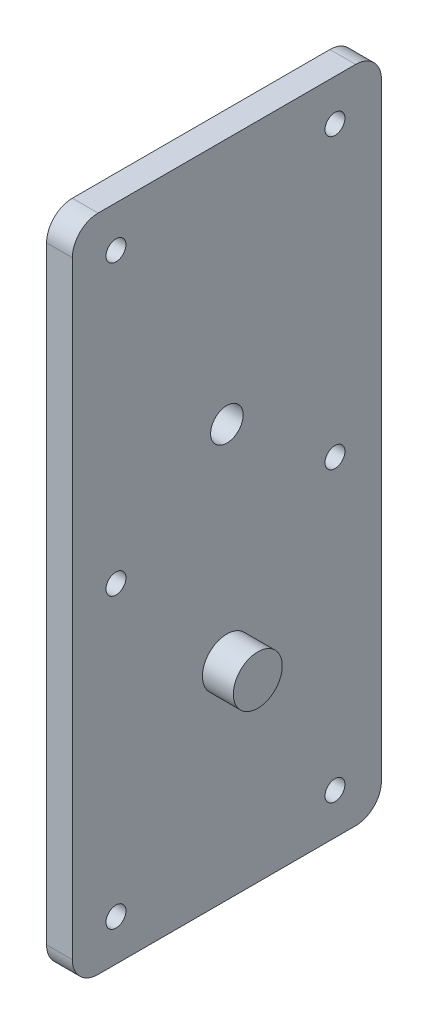
ISO-10303-21;
HEADER;
FILE_DESCRIPTION(('STEP AP214'),'2;1');
FILE_NAME('part.step','',(''),(''),'','','');
FILE_SCHEMA(('AUTOMOTIVE_DESIGN { 1 0 10303 214 1 1 1 1 }'));
ENDSEC;
DATA;
#1=APPLICATION_CONTEXT('core data for automotive mechanical design processes');
#2=APPLICATION_PROTOCOL_DEFINITION('international standard','automotive_design',2000,#1);
#3=PRODUCT_CONTEXT('',#1,'mechanical');
#4=PRODUCT('Part','Part','',(#3));
#5=PRODUCT_RELATED_PRODUCT_CATEGORY('part','',(#4));
#6=PRODUCT_DEFINITION_FORMATION('','',#4);
#7=PRODUCT_DEFINITION_CONTEXT('part definition',#1,'design');
#8=PRODUCT_DEFINITION('design','',#6,#7);
#9=PRODUCT_DEFINITION_SHAPE('','',#8);
#10=(LENGTH_UNIT() NAMED_UNIT(*) SI_UNIT(.MILLI.,.METRE.));
#11=(NAMED_UNIT(*) PLANE_ANGLE_UNIT() SI_UNIT($,.RADIAN.));
#12=(NAMED_UNIT(*) SI_UNIT($,.STERADIAN.) SOLID_ANGLE_UNIT());
#13=UNCERTAINTY_MEASURE_WITH_UNIT(LENGTH_MEASURE(1.E-05),#10,'distance_accuracy_value','');
#14=(GEOMETRIC_REPRESENTATION_CONTEXT(3) GLOBAL_UNCERTAINTY_ASSIGNED_CONTEXT((#13)) GLOBAL_UNIT_ASSIGNED_CONTEXT((#10,
#11,#12)) REPRESENTATION_CONTEXT('',''));
#15=CARTESIAN_POINT('',(0.,0.,0.));
#16=DIRECTION('',(0.,0.,1.));
#17=DIRECTION('',(1.,0.,0.));
#18=AXIS2_PLACEMENT_3D('',#15,#16,#17);
#19=CARTESIAN_POINT('',(6.35,-44.45,31.75));
#20=DIRECTION('',(-1.,0.,0.));
#21=DIRECTION('',(0.,0.,1.));
#22=AXIS2_PLACEMENT_3D('',#19,#20,#21);
#23=CYLINDRICAL_SURFACE('',#22,6.35);
#24=CARTESIAN_POINT('',(0.,-44.45,31.75));
#25=DIRECTION('',(1.,0.,0.));
#26=DIRECTION('',(0.,0.,1.));
#27=AXIS2_PLACEMENT_3D('',#24,#25,#26);
#28=CIRCLE('',#27,6.35);
#29=CARTESIAN_POINT('',(0.,-44.45,38.1));
#30=VERTEX_POINT('',#29);
#31=CARTESIAN_POINT('',(0.,-50.8,31.7499999999999));
#32=VERTEX_POINT('',#31);
#33=EDGE_CURVE('E130',#30,#32,#28,.T.);
#34=ORIENTED_EDGE('',*,*,#33,.T.);
#35=DIRECTION('',(-1.,0.,0.));
#36=VECTOR('',#35,1.);
#37=CARTESIAN_POINT('',(6.35,-50.8,31.7499999999999));
#38=LINE('',#37,#36);
#39=CARTESIAN_POINT('',(6.35,-50.8,31.7499999999999));
#40=VERTEX_POINT('',#39);
#41=EDGE_CURVE('E41',#40,#32,#38,.T.);
#42=ORIENTED_EDGE('',*,*,#41,.F.);
#43=CARTESIAN_POINT('',(6.35,-44.45,31.75));
#44=DIRECTION('',(1.,0.,0.));
#45=DIRECTION('',(0.,0.,1.));
#46=AXIS2_PLACEMENT_3D('',#43,#44,#45);
#47=CIRCLE('',#46,6.35);
#48=CARTESIAN_POINT('',(6.35,-44.45,38.1));
#49=VERTEX_POINT('',#48);
#50=EDGE_CURVE('E145',#49,#40,#47,.T.);
#51=ORIENTED_EDGE('',*,*,#50,.F.);
#52=DIRECTION('',(-1.,0.,0.));
#53=VECTOR('',#52,1.);
#54=CARTESIAN_POINT('',(6.35,-44.45,38.1));
#55=LINE('',#54,#53);
#56=EDGE_CURVE('E126',#49,#30,#55,.T.);
#57=ORIENTED_EDGE('',*,*,#56,.T.);
#58=EDGE_LOOP('',(#34,#42,#51,#57));
#59=FACE_BOUND('',#58,.T.);
#60=ADVANCED_FACE('F33',(#59),#23,.T.);
#61=CARTESIAN_POINT('',(6.35,-50.8,31.7499999999999));
#62=DIRECTION('',(0.,1.,0.));
#63=DIRECTION('',(0.,0.,1.));
#64=AXIS2_PLACEMENT_3D('',#61,#62,#63);
#65=PLANE('',#64);
#66=DIRECTION('',(0.,0.,-1.));
#67=VECTOR('',#66,1.);
#68=CARTESIAN_POINT('',(0.,-50.8,31.7499999999999));
#69=LINE('',#68,#67);
#70=CARTESIAN_POINT('',(0.,-50.8,-31.75));
#71=VERTEX_POINT('',#70);
#72=EDGE_CURVE('E133',#32,#71,#69,.T.);
#73=ORIENTED_EDGE('',*,*,#72,.T.);
#74=DIRECTION('',(-1.,0.,0.));
#75=VECTOR('',#74,1.);
#76=CARTESIAN_POINT('',(6.35,-50.8,-31.75));
#77=LINE('',#76,#75);
#78=CARTESIAN_POINT('',(6.35,-50.8,-31.75));
#79=VERTEX_POINT('',#78);
#80=EDGE_CURVE('E155',#79,#71,#77,.T.);
#81=ORIENTED_EDGE('',*,*,#80,.F.);
#82=DIRECTION('',(0.,0.,-1.));
#83=VECTOR('',#82,1.);
#84=CARTESIAN_POINT('',(6.35,-50.8,31.7499999999999));
#85=LINE('',#84,#83);
#86=EDGE_CURVE('E93',#40,#79,#85,.T.);
#87=ORIENTED_EDGE('',*,*,#86,.F.);
#88=ORIENTED_EDGE('',*,*,#41,.T.);
#89=EDGE_LOOP('',(#73,#81,#87,#88));
#90=FACE_BOUND('',#89,.T.);
#91=ADVANCED_FACE('F158',(#90),#65,.F.);
#92=CARTESIAN_POINT('',(6.35,-44.45,-31.75));
#93=DIRECTION('',(-1.,0.,0.));
#94=DIRECTION('',(0.,0.,1.));
#95=AXIS2_PLACEMENT_3D('',#92,#93,#94);
#96=CYLINDRICAL_SURFACE('',#95,6.35);
#97=CARTESIAN_POINT('',(0.,-44.45,-31.75));
#98=DIRECTION('',(1.,0.,0.));
#99=DIRECTION('',(0.,0.,-1.));
#100=AXIS2_PLACEMENT_3D('',#97,#98,#99);
#101=CIRCLE('',#100,6.35);
#102=CARTESIAN_POINT('',(0.,-44.45,-38.1));
#103=VERTEX_POINT('',#102);
#104=EDGE_CURVE('E136',#71,#103,#101,.T.);
#105=ORIENTED_EDGE('',*,*,#104,.T.);
#106=DIRECTION('',(-1.,0.,0.));
#107=VECTOR('',#106,1.);
#108=CARTESIAN_POINT('',(6.35,-44.45,-38.1));
#109=LINE('',#108,#107);
#110=CARTESIAN_POINT('',(6.35,-44.45,-38.1));
#111=VERTEX_POINT('',#110);
#112=EDGE_CURVE('E152',#111,#103,#109,.T.);
#113=ORIENTED_EDGE('',*,*,#112,.F.);
#114=CARTESIAN_POINT('',(6.35,-44.45,-31.75));
#115=DIRECTION('',(1.,0.,0.));
#116=DIRECTION('',(0.,0.,-1.));
#117=AXIS2_PLACEMENT_3D('',#114,#115,#116);
#118=CIRCLE('',#117,6.35);
#119=EDGE_CURVE('E176',#79,#111,#118,.T.);
#120=ORIENTED_EDGE('',*,*,#119,.F.);
#121=ORIENTED_EDGE('',*,*,#80,.T.);
#122=EDGE_LOOP('',(#105,#113,#120,#121));
#123=FACE_BOUND('',#122,.T.);
#124=ADVANCED_FACE('F169',(#123),#96,.T.);
#125=CARTESIAN_POINT('',(6.35,-44.45,-38.1));
#126=DIRECTION('',(0.,0.,1.));
#127=DIRECTION('',(1.,0.,0.));
#128=AXIS2_PLACEMENT_3D('',#125,#126,#127);
#129=PLANE('',#128);
#130=DIRECTION('',(0.,1.,0.));
#131=VECTOR('',#130,1.);
#132=CARTESIAN_POINT('',(0.,-44.45,-38.1));
#133=LINE('',#132,#131);
#134=CARTESIAN_POINT('',(0.,105.41,-38.1));
#135=VERTEX_POINT('',#134);
#136=EDGE_CURVE('E138',#103,#135,#133,.T.);
#137=ORIENTED_EDGE('',*,*,#136,.T.);
#138=DIRECTION('',(-1.,0.,0.));
#139=VECTOR('',#138,1.);
#140=CARTESIAN_POINT('',(6.35,105.41,-38.1));
#141=LINE('',#140,#139);
#142=CARTESIAN_POINT('',(6.35,105.41,-38.1));
#143=VERTEX_POINT('',#142);
#144=EDGE_CURVE('E149',#143,#135,#141,.T.);
#145=ORIENTED_EDGE('',*,*,#144,.F.);
#146=DIRECTION('',(0.,1.,0.));
#147=VECTOR('',#146,1.);
#148=CARTESIAN_POINT('',(6.35,-44.45,-38.1));
#149=LINE('',#148,#147);
#150=EDGE_CURVE('E175',#111,#143,#149,.T.);
#151=ORIENTED_EDGE('',*,*,#150,.F.);
#152=ORIENTED_EDGE('',*,*,#112,.T.);
#153=EDGE_LOOP('',(#137,#145,#151,#152));
#154=FACE_BOUND('',#153,.T.);
#155=ADVANCED_FACE('F173',(#154),#129,.F.);
#156=CARTESIAN_POINT('',(6.35,105.41,-31.75));
#157=DIRECTION('',(-1.,0.,0.));
#158=DIRECTION('',(0.,0.,1.));
#159=AXIS2_PLACEMENT_3D('',#156,#157,#158);
#160=CYLINDRICAL_SURFACE('',#159,6.35);
#161=CARTESIAN_POINT('',(0.,105.41,-31.75));
#162=DIRECTION('',(1.,0.,0.));
#163=DIRECTION('',(0.,0.,-1.));
#164=AXIS2_PLACEMENT_3D('',#161,#162,#163);
#165=CIRCLE('',#164,6.35);
#166=CARTESIAN_POINT('',(0.,111.76,-31.75));
#167=VERTEX_POINT('',#166);
#168=EDGE_CURVE('E140',#135,#167,#165,.T.);
#169=ORIENTED_EDGE('',*,*,#168,.T.);
#170=DIRECTION('',(-1.,0.,0.));
#171=VECTOR('',#170,1.);
#172=CARTESIAN_POINT('',(6.35,111.76,-31.75));
#173=LINE('',#172,#171);
#174=CARTESIAN_POINT('',(6.35,111.76,-31.75));
#175=VERTEX_POINT('',#174);
#176=EDGE_CURVE('E121',#175,#167,#173,.T.);
#177=ORIENTED_EDGE('',*,*,#176,.F.);
#178=CARTESIAN_POINT('',(6.35,105.41,-31.75));
#179=DIRECTION('',(1.,0.,0.));
#180=DIRECTION('',(0.,0.,-1.));
#181=AXIS2_PLACEMENT_3D('',#178,#179,#180);
#182=CIRCLE('',#181,6.35);
#183=EDGE_CURVE('E112',#143,#175,#182,.T.);
#184=ORIENTED_EDGE('',*,*,#183,.F.);
#185=ORIENTED_EDGE('',*,*,#144,.T.);
#186=EDGE_LOOP('',(#169,#177,#184,#185));
#187=FACE_BOUND('',#186,.T.);
#188=ADVANCED_FACE('F273',(#187),#160,.T.);
#189=CARTESIAN_POINT('',(6.35,111.76,31.7499999999999));
#190=DIRECTION('',(0.,-1.,0.));
#191=DIRECTION('',(0.,0.,-1.));
#192=AXIS2_PLACEMENT_3D('',#189,#190,#191);
#193=PLANE('',#192);
#194=DIRECTION('',(0.,0.,1.));
#195=VECTOR('',#194,1.);
#196=CARTESIAN_POINT('',(0.,111.76,31.7499999999999));
#197=LINE('',#196,#195);
#198=CARTESIAN_POINT('',(0.,111.76,31.7499999999999));
#199=VERTEX_POINT('',#198);
#200=EDGE_CURVE('E120',#167,#199,#197,.T.);
#201=ORIENTED_EDGE('',*,*,#200,.T.);
#202=DIRECTION('',(-1.,0.,0.));
#203=VECTOR('',#202,1.);
#204=CARTESIAN_POINT('',(6.35,111.76,31.7499999999999));
#205=LINE('',#204,#203);
#206=CARTESIAN_POINT('',(6.35,111.76,31.7499999999999));
#207=VERTEX_POINT('',#206);
#208=EDGE_CURVE('E117',#207,#199,#205,.T.);
#209=ORIENTED_EDGE('',*,*,#208,.F.);
#210=DIRECTION('',(0.,0.,1.));
#211=VECTOR('',#210,1.);
#212=CARTESIAN_POINT('',(6.35,111.76,31.7499999999999));
#213=LINE('',#212,#211);
#214=EDGE_CURVE('E106',#175,#207,#213,.T.);
#215=ORIENTED_EDGE('',*,*,#214,.F.);
#216=ORIENTED_EDGE('',*,*,#176,.T.);
#217=EDGE_LOOP('',(#201,#209,#215,#216));
#218=FACE_BOUND('',#217,.T.);
#219=ADVANCED_FACE('F118',(#218),#193,.F.);
#220=CARTESIAN_POINT('',(6.35,105.41,31.75));
#221=DIRECTION('',(-1.,0.,0.));
#222=DIRECTION('',(0.,0.,1.));
#223=AXIS2_PLACEMENT_3D('',#220,#221,#222);
#224=CYLINDRICAL_SURFACE('',#223,6.35);
#225=CARTESIAN_POINT('',(0.,105.41,31.75));
#226=DIRECTION('',(1.,0.,0.));
#227=DIRECTION('',(0.,0.,1.));
#228=AXIS2_PLACEMENT_3D('',#225,#226,#227);
#229=CIRCLE('',#228,6.35);
#230=CARTESIAN_POINT('',(0.,105.41,38.1));
#231=VERTEX_POINT('',#230);
#232=EDGE_CURVE('E78',#199,#231,#229,.T.);
#233=ORIENTED_EDGE('',*,*,#232,.T.);
#234=DIRECTION('',(-1.,0.,0.));
#235=VECTOR('',#234,1.);
#236=CARTESIAN_POINT('',(6.35,105.41,38.1));
#237=LINE('',#236,#235);
#238=CARTESIAN_POINT('',(6.35,105.41,38.1));
#239=VERTEX_POINT('',#238);
#240=EDGE_CURVE('E122',#239,#231,#237,.T.);
#241=ORIENTED_EDGE('',*,*,#240,.F.);
#242=CARTESIAN_POINT('',(6.35,105.41,31.75));
#243=DIRECTION('',(1.,0.,0.));
#244=DIRECTION('',(0.,0.,1.));
#245=AXIS2_PLACEMENT_3D('',#242,#243,#244);
#246=CIRCLE('',#245,6.35);
#247=EDGE_CURVE('E110',#207,#239,#246,.T.);
#248=ORIENTED_EDGE('',*,*,#247,.F.);
#249=ORIENTED_EDGE('',*,*,#208,.T.);
#250=EDGE_LOOP('',(#233,#241,#248,#249));
#251=FACE_BOUND('',#250,.T.);
#252=ADVANCED_FACE('F124',(#251),#224,.T.);
#253=CARTESIAN_POINT('',(6.35,-44.45,38.1));
#254=DIRECTION('',(0.,0.,-1.));
#255=DIRECTION('',(-1.,0.,0.));
#256=AXIS2_PLACEMENT_3D('',#253,#254,#255);
#257=PLANE('',#256);
#258=DIRECTION('',(0.,-1.,0.));
#259=VECTOR('',#258,1.);
#260=CARTESIAN_POINT('',(0.,-44.45,38.1));
#261=LINE('',#260,#259);
#262=EDGE_CURVE('E84',#231,#30,#261,.T.);
#263=ORIENTED_EDGE('',*,*,#262,.T.);
#264=ORIENTED_EDGE('',*,*,#56,.F.);
#265=DIRECTION('',(0.,-1.,0.));
#266=VECTOR('',#265,1.);
#267=CARTESIAN_POINT('',(6.35,-44.45,38.1));
#268=LINE('',#267,#266);
#269=EDGE_CURVE('E49',#239,#49,#268,.T.);
#270=ORIENTED_EDGE('',*,*,#269,.F.);
#271=ORIENTED_EDGE('',*,*,#240,.T.);
#272=EDGE_LOOP('',(#263,#264,#270,#271));
#273=FACE_BOUND('',#272,.T.);
#274=ADVANCED_FACE('F231',(#273),#257,.F.);
#275=CARTESIAN_POINT('',(6.35,-44.45,31.75));
#276=DIRECTION('',(-1.,0.,0.));
#277=DIRECTION('',(0.,0.,1.));
#278=AXIS2_PLACEMENT_3D('',#275,#276,#277);
#279=PLANE('',#278);
#280=CARTESIAN_POINT('',(6.35,50.8,0.));
#281=DIRECTION('',(1.,0.,0.));
#282=DIRECTION('',(0.,0.,-1.));
#283=AXIS2_PLACEMENT_3D('',#280,#281,#282);
#284=CIRCLE('',#283,4.0132);
#285=CARTESIAN_POINT('',(6.35,50.8,-4.0132));
#286=VERTEX_POINT('',#285);
#287=EDGE_CURVE('E223',#286,#286,#284,.T.);
#288=ORIENTED_EDGE('',*,*,#287,.F.);
#289=EDGE_LOOP('',(#288));
#290=FACE_BOUND('',#289,.T.);
#291=CARTESIAN_POINT('',(6.35,101.600261,-26.646533));
#292=DIRECTION('',(-1.,0.,0.));
#293=DIRECTION('',(0.,0.,1.));
#294=AXIS2_PLACEMENT_3D('',#291,#292,#293);
#295=CIRCLE('',#294,2.45745);
#296=CARTESIAN_POINT('',(6.35,101.600261,-24.189083));
#297=VERTEX_POINT('',#296);
#298=EDGE_CURVE('E214',#297,#297,#295,.T.);
#299=ORIENTED_EDGE('',*,*,#298,.T.);
#300=EDGE_LOOP('',(#299));
#301=FACE_BOUND('',#300,.T.);
#302=CARTESIAN_POINT('',(6.35,101.600261,27.342012));
#303=DIRECTION('',(-1.,0.,0.));
#304=DIRECTION('',(0.,0.,1.));
#305=AXIS2_PLACEMENT_3D('',#302,#303,#304);
#306=CIRCLE('',#305,2.45745);
#307=CARTESIAN_POINT('',(6.35,101.600261,29.799462));
#308=VERTEX_POINT('',#307);
#309=EDGE_CURVE('E208',#308,#308,#306,.T.);
#310=ORIENTED_EDGE('',*,*,#309,.T.);
#311=EDGE_LOOP('',(#310));
#312=FACE_BOUND('',#311,.T.);
#313=CARTESIAN_POINT('',(6.35,30.480261,27.342012));
#314=DIRECTION('',(-1.,0.,0.));
#315=DIRECTION('',(0.,0.,1.));
#316=AXIS2_PLACEMENT_3D('',#313,#314,#315);
#317=CIRCLE('',#316,2.45745);
#318=CARTESIAN_POINT('',(6.35,30.480261,29.799462));
#319=VERTEX_POINT('',#318);
#320=EDGE_CURVE('E202',#319,#319,#317,.T.);
#321=ORIENTED_EDGE('',*,*,#320,.T.);
#322=EDGE_LOOP('',(#321));
#323=FACE_BOUND('',#322,.T.);
#324=CARTESIAN_POINT('',(6.35,30.480261,-26.646533));
#325=DIRECTION('',(-1.,0.,0.));
#326=DIRECTION('',(0.,0.,1.));
#327=AXIS2_PLACEMENT_3D('',#324,#325,#326);
#328=CIRCLE('',#327,2.45745);
#329=CARTESIAN_POINT('',(6.35,30.480261,-24.189083));
#330=VERTEX_POINT('',#329);
#331=EDGE_CURVE('E196',#330,#330,#328,.T.);
#332=ORIENTED_EDGE('',*,*,#331,.T.);
#333=EDGE_LOOP('',(#332));
#334=FACE_BOUND('',#333,.T.);
#335=CARTESIAN_POINT('',(6.35,-40.639739,-26.646533));
#336=DIRECTION('',(-1.,0.,0.));
#337=DIRECTION('',(0.,0.,1.));
#338=AXIS2_PLACEMENT_3D('',#335,#336,#337);
#339=CIRCLE('',#338,2.45745);
#340=CARTESIAN_POINT('',(6.35,-40.639739,-24.189083));
#341=VERTEX_POINT('',#340);
#342=EDGE_CURVE('E190',#341,#341,#339,.T.);
#343=ORIENTED_EDGE('',*,*,#342,.T.);
#344=EDGE_LOOP('',(#343));
#345=FACE_BOUND('',#344,.T.);
#346=CARTESIAN_POINT('',(6.35,-40.639739,27.342012));
#347=DIRECTION('',(-1.,0.,0.));
#348=DIRECTION('',(0.,0.,1.));
#349=AXIS2_PLACEMENT_3D('',#346,#347,#348);
#350=CIRCLE('',#349,2.45745);
#351=CARTESIAN_POINT('',(6.35,-40.639739,29.799462));
#352=VERTEX_POINT('',#351);
#353=EDGE_CURVE('E184',#352,#352,#350,.T.);
#354=ORIENTED_EDGE('',*,*,#353,.T.);
#355=EDGE_LOOP('',(#354));
#356=FACE_BOUND('',#355,.T.);
#357=CARTESIAN_POINT('',(6.35,0.,0.));
#358=DIRECTION('',(-1.,0.,0.));
#359=DIRECTION('',(0.,0.,1.));
#360=AXIS2_PLACEMENT_3D('',#357,#358,#359);
#361=CIRCLE('',#360,6.0325);
#362=CARTESIAN_POINT('',(6.35,0.,6.0325));
#363=VERTEX_POINT('',#362);
#364=EDGE_CURVE('E11',#363,#363,#361,.F.);
#365=ORIENTED_EDGE('',*,*,#364,.F.);
#366=EDGE_LOOP('',(#365));
#367=FACE_BOUND('',#366,.T.);
#368=ORIENTED_EDGE('',*,*,#50,.T.);
#369=ORIENTED_EDGE('',*,*,#86,.T.);
#370=ORIENTED_EDGE('',*,*,#119,.T.);
#371=ORIENTED_EDGE('',*,*,#150,.T.);
#372=ORIENTED_EDGE('',*,*,#183,.T.);
#373=ORIENTED_EDGE('',*,*,#214,.T.);
#374=ORIENTED_EDGE('',*,*,#247,.T.);
#375=ORIENTED_EDGE('',*,*,#269,.T.);
#376=EDGE_LOOP('',(#368,#369,#370,#371,#372,#373,#374,#375));
#377=FACE_BOUND('',#376,.T.);
#378=ADVANCED_FACE('F108',(#290,#301,#312,#323,#334,#345,#356,#367,#377),#279,.F.);
#379=CARTESIAN_POINT('',(0.,-44.45,31.75));
#380=DIRECTION('',(-1.,0.,0.));
#381=DIRECTION('',(0.,0.,1.));
#382=AXIS2_PLACEMENT_3D('',#379,#380,#381);
#383=PLANE('',#382);
#384=CARTESIAN_POINT('',(0.,50.8,0.));
#385=DIRECTION('',(1.,0.,0.));
#386=DIRECTION('',(0.,0.,-1.));
#387=AXIS2_PLACEMENT_3D('',#384,#385,#386);
#388=CIRCLE('',#387,4.0132);
#389=CARTESIAN_POINT('',(0.,50.8,-4.0132));
#390=VERTEX_POINT('',#389);
#391=EDGE_CURVE('E220',#390,#390,#388,.T.);
#392=ORIENTED_EDGE('',*,*,#391,.T.);
#393=EDGE_LOOP('',(#392));
#394=FACE_BOUND('',#393,.T.);
#395=CARTESIAN_POINT('',(0.,101.600261,-26.646533));
#396=DIRECTION('',(-1.,0.,0.));
#397=DIRECTION('',(0.,0.,1.));
#398=AXIS2_PLACEMENT_3D('',#395,#396,#397);
#399=CIRCLE('',#398,2.45745);
#400=CARTESIAN_POINT('',(0.,101.600261,-24.189083));
#401=VERTEX_POINT('',#400);
#402=EDGE_CURVE('E217',#401,#401,#399,.T.);
#403=ORIENTED_EDGE('',*,*,#402,.F.);
#404=EDGE_LOOP('',(#403));
#405=FACE_BOUND('',#404,.T.);
#406=CARTESIAN_POINT('',(0.,101.600261,27.342012));
#407=DIRECTION('',(-1.,0.,0.));
#408=DIRECTION('',(0.,0.,1.));
#409=AXIS2_PLACEMENT_3D('',#406,#407,#408);
#410=CIRCLE('',#409,2.45745);
#411=CARTESIAN_POINT('',(0.,101.600261,29.799462));
#412=VERTEX_POINT('',#411);
#413=EDGE_CURVE('E211',#412,#412,#410,.T.);
#414=ORIENTED_EDGE('',*,*,#413,.F.);
#415=EDGE_LOOP('',(#414));
#416=FACE_BOUND('',#415,.T.);
#417=CARTESIAN_POINT('',(0.,30.480261,27.342012));
#418=DIRECTION('',(-1.,0.,0.));
#419=DIRECTION('',(0.,0.,1.));
#420=AXIS2_PLACEMENT_3D('',#417,#418,#419);
#421=CIRCLE('',#420,2.45745);
#422=CARTESIAN_POINT('',(0.,30.480261,29.799462));
#423=VERTEX_POINT('',#422);
#424=EDGE_CURVE('E205',#423,#423,#421,.T.);
#425=ORIENTED_EDGE('',*,*,#424,.F.);
#426=EDGE_LOOP('',(#425));
#427=FACE_BOUND('',#426,.T.);
#428=CARTESIAN_POINT('',(0.,30.480261,-26.646533));
#429=DIRECTION('',(-1.,0.,0.));
#430=DIRECTION('',(0.,0.,1.));
#431=AXIS2_PLACEMENT_3D('',#428,#429,#430);
#432=CIRCLE('',#431,2.45745);
#433=CARTESIAN_POINT('',(0.,30.480261,-24.189083));
#434=VERTEX_POINT('',#433);
#435=EDGE_CURVE('E199',#434,#434,#432,.T.);
#436=ORIENTED_EDGE('',*,*,#435,.F.);
#437=EDGE_LOOP('',(#436));
#438=FACE_BOUND('',#437,.T.);
#439=CARTESIAN_POINT('',(0.,-40.639739,-26.646533));
#440=DIRECTION('',(-1.,0.,0.));
#441=DIRECTION('',(0.,0.,1.));
#442=AXIS2_PLACEMENT_3D('',#439,#440,#441);
#443=CIRCLE('',#442,2.45745);
#444=CARTESIAN_POINT('',(0.,-40.639739,-24.189083));
#445=VERTEX_POINT('',#444);
#446=EDGE_CURVE('E193',#445,#445,#443,.T.);
#447=ORIENTED_EDGE('',*,*,#446,.F.);
#448=EDGE_LOOP('',(#447));
#449=FACE_BOUND('',#448,.T.);
#450=CARTESIAN_POINT('',(0.,-40.639739,27.342012));
#451=DIRECTION('',(-1.,0.,0.));
#452=DIRECTION('',(0.,0.,1.));
#453=AXIS2_PLACEMENT_3D('',#450,#451,#452);
#454=CIRCLE('',#453,2.45745);
#455=CARTESIAN_POINT('',(0.,-40.639739,29.799462));
#456=VERTEX_POINT('',#455);
#457=EDGE_CURVE('E187',#456,#456,#454,.T.);
#458=ORIENTED_EDGE('',*,*,#457,.F.);
#459=EDGE_LOOP('',(#458));
#460=FACE_BOUND('',#459,.T.);
#461=ORIENTED_EDGE('',*,*,#33,.F.);
#462=ORIENTED_EDGE('',*,*,#262,.F.);
#463=ORIENTED_EDGE('',*,*,#232,.F.);
#464=ORIENTED_EDGE('',*,*,#200,.F.);
#465=ORIENTED_EDGE('',*,*,#168,.F.);
#466=ORIENTED_EDGE('',*,*,#136,.F.);
#467=ORIENTED_EDGE('',*,*,#104,.F.);
#468=ORIENTED_EDGE('',*,*,#72,.F.);
#469=EDGE_LOOP('',(#461,#462,#463,#464,#465,#466,#467,#468));
#470=FACE_BOUND('',#469,.T.);
#471=ADVANCED_FACE('F163',(#394,#405,#416,#427,#438,#449,#460,#470),#383,.T.);
#472=CARTESIAN_POINT('',(13.97,0.,0.));
#473=DIRECTION('',(-1.,0.,0.));
#474=DIRECTION('',(0.,0.,1.));
#475=AXIS2_PLACEMENT_3D('',#472,#473,#474);
#476=CYLINDRICAL_SURFACE('',#475,6.0325);
#477=CARTESIAN_POINT('',(13.97,0.,0.));
#478=DIRECTION('',(1.,0.,0.));
#479=DIRECTION('',(0.,0.,-1.));
#480=AXIS2_PLACEMENT_3D('',#477,#478,#479);
#481=CIRCLE('',#480,6.0325);
#482=CARTESIAN_POINT('',(13.97,0.,-6.0325));
#483=VERTEX_POINT('',#482);
#484=EDGE_CURVE('E134',#483,#483,#481,.T.);
#485=ORIENTED_EDGE('',*,*,#484,.F.);
#486=EDGE_LOOP('',(#485));
#487=FACE_BOUND('',#486,.T.);
#488=ORIENTED_EDGE('',*,*,#364,.T.);
#489=EDGE_LOOP('',(#488));
#490=FACE_BOUND('',#489,.T.);
#491=ADVANCED_FACE('F247',(#487,#490),#476,.T.);
#492=CARTESIAN_POINT('',(13.97,0.,0.));
#493=DIRECTION('',(1.,0.,0.));
#494=DIRECTION('',(0.,0.,-1.));
#495=AXIS2_PLACEMENT_3D('',#492,#493,#494);
#496=PLANE('',#495);
#497=ORIENTED_EDGE('',*,*,#484,.T.);
#498=EDGE_LOOP('',(#497));
#499=FACE_BOUND('',#498,.T.);
#500=ADVANCED_FACE('F249',(#499),#496,.T.);
#501=CARTESIAN_POINT('',(0.,-40.639739,27.342012));
#502=DIRECTION('',(-1.,0.,0.));
#503=DIRECTION('',(0.,0.,1.));
#504=AXIS2_PLACEMENT_3D('',#501,#502,#503);
#505=CYLINDRICAL_SURFACE('',#504,2.45745);
#506=ORIENTED_EDGE('',*,*,#353,.F.);
#507=EDGE_LOOP('',(#506));
#508=FACE_BOUND('',#507,.T.);
#509=ORIENTED_EDGE('',*,*,#457,.T.);
#510=EDGE_LOOP('',(#509));
#511=FACE_BOUND('',#510,.T.);
#512=ADVANCED_FACE('F256',(#508,#511),#505,.F.);
#513=CARTESIAN_POINT('',(0.,-40.639739,-26.646533));
#514=DIRECTION('',(-1.,0.,0.));
#515=DIRECTION('',(0.,0.,1.));
#516=AXIS2_PLACEMENT_3D('',#513,#514,#515);
#517=CYLINDRICAL_SURFACE('',#516,2.45745);
#518=ORIENTED_EDGE('',*,*,#342,.F.);
#519=EDGE_LOOP('',(#518));
#520=FACE_BOUND('',#519,.T.);
#521=ORIENTED_EDGE('',*,*,#446,.T.);
#522=EDGE_LOOP('',(#521));
#523=FACE_BOUND('',#522,.T.);
#524=ADVANCED_FACE('F337',(#520,#523),#517,.F.);
#525=CARTESIAN_POINT('',(0.,30.480261,-26.646533));
#526=DIRECTION('',(-1.,0.,0.));
#527=DIRECTION('',(0.,0.,1.));
#528=AXIS2_PLACEMENT_3D('',#525,#526,#527);
#529=CYLINDRICAL_SURFACE('',#528,2.45745);
#530=ORIENTED_EDGE('',*,*,#331,.F.);
#531=EDGE_LOOP('',(#530));
#532=FACE_BOUND('',#531,.T.);
#533=ORIENTED_EDGE('',*,*,#435,.T.);
#534=EDGE_LOOP('',(#533));
#535=FACE_BOUND('',#534,.T.);
#536=ADVANCED_FACE('F329',(#532,#535),#529,.F.);
#537=CARTESIAN_POINT('',(0.,30.480261,27.342012));
#538=DIRECTION('',(-1.,0.,0.));
#539=DIRECTION('',(0.,0.,1.));
#540=AXIS2_PLACEMENT_3D('',#537,#538,#539);
#541=CYLINDRICAL_SURFACE('',#540,2.45745);
#542=ORIENTED_EDGE('',*,*,#320,.F.);
#543=EDGE_LOOP('',(#542));
#544=FACE_BOUND('',#543,.T.);
#545=ORIENTED_EDGE('',*,*,#424,.T.);
#546=EDGE_LOOP('',(#545));
#547=FACE_BOUND('',#546,.T.);
#548=ADVANCED_FACE('F321',(#544,#547),#541,.F.);
#549=CARTESIAN_POINT('',(0.,101.600261,27.342012));
#550=DIRECTION('',(-1.,0.,0.));
#551=DIRECTION('',(0.,0.,1.));
#552=AXIS2_PLACEMENT_3D('',#549,#550,#551);
#553=CYLINDRICAL_SURFACE('',#552,2.45745);
#554=ORIENTED_EDGE('',*,*,#309,.F.);
#555=EDGE_LOOP('',(#554));
#556=FACE_BOUND('',#555,.T.);
#557=ORIENTED_EDGE('',*,*,#413,.T.);
#558=EDGE_LOOP('',(#557));
#559=FACE_BOUND('',#558,.T.);
#560=ADVANCED_FACE('F314',(#556,#559),#553,.F.);
#561=CARTESIAN_POINT('',(0.,101.600261,-26.646533));
#562=DIRECTION('',(-1.,0.,0.));
#563=DIRECTION('',(0.,0.,1.));
#564=AXIS2_PLACEMENT_3D('',#561,#562,#563);
#565=CYLINDRICAL_SURFACE('',#564,2.45745);
#566=ORIENTED_EDGE('',*,*,#298,.F.);
#567=EDGE_LOOP('',(#566));
#568=FACE_BOUND('',#567,.T.);
#569=ORIENTED_EDGE('',*,*,#402,.T.);
#570=EDGE_LOOP('',(#569));
#571=FACE_BOUND('',#570,.T.);
#572=ADVANCED_FACE('F304',(#568,#571),#565,.F.);
#573=CARTESIAN_POINT('',(6.35,50.8,0.));
#574=DIRECTION('',(1.,0.,0.));
#575=DIRECTION('',(0.,0.,-1.));
#576=AXIS2_PLACEMENT_3D('',#573,#574,#575);
#577=CYLINDRICAL_SURFACE('',#576,4.0132);
#578=ORIENTED_EDGE('',*,*,#391,.F.);
#579=EDGE_LOOP('',(#578));
#580=FACE_BOUND('',#579,.T.);
#581=ORIENTED_EDGE('',*,*,#287,.T.);
#582=EDGE_LOOP('',(#581));
#583=FACE_BOUND('',#582,.T.);
#584=ADVANCED_FACE('F227',(#580,#583),#577,.F.);
#585=CLOSED_SHELL('',(#60,#91,#124,#155,#188,#219,#252,#274,#378,#471,#491,#500,#512,#524,#536,
#548,#560,#572,#584));
#586=MANIFOLD_SOLID_BREP('B2',#585);
#587=ADVANCED_BREP_SHAPE_REPRESENTATION('',(#18,#586),#14);
#588=SHAPE_DEFINITION_REPRESENTATION(#9,#587);
ENDSEC;
END-ISO-10303-21;
